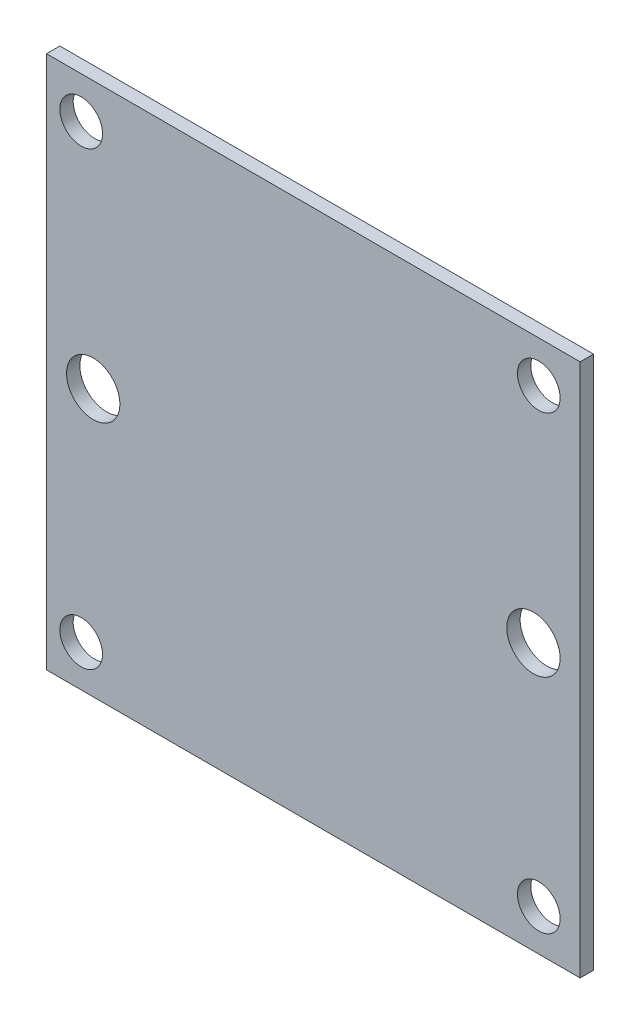
ISO-10303-21;
HEADER;
FILE_DESCRIPTION(('STEP AP214'),'2;1');
FILE_NAME('part.step','',(''),(''),'','','');
FILE_SCHEMA(('AUTOMOTIVE_DESIGN { 1 0 10303 214 1 1 1 1 }'));
ENDSEC;
DATA;
#1=APPLICATION_CONTEXT('core data for automotive mechanical design processes');
#2=APPLICATION_PROTOCOL_DEFINITION('international standard','automotive_design',2000,#1);
#3=PRODUCT_CONTEXT('',#1,'mechanical');
#4=PRODUCT('Part','Part','',(#3));
#5=PRODUCT_RELATED_PRODUCT_CATEGORY('part','',(#4));
#6=PRODUCT_DEFINITION_FORMATION('','',#4);
#7=PRODUCT_DEFINITION_CONTEXT('part definition',#1,'design');
#8=PRODUCT_DEFINITION('design','',#6,#7);
#9=PRODUCT_DEFINITION_SHAPE('','',#8);
#10=(LENGTH_UNIT() NAMED_UNIT(*) SI_UNIT(.MILLI.,.METRE.));
#11=(NAMED_UNIT(*) PLANE_ANGLE_UNIT() SI_UNIT($,.RADIAN.));
#12=(NAMED_UNIT(*) SI_UNIT($,.STERADIAN.) SOLID_ANGLE_UNIT());
#13=UNCERTAINTY_MEASURE_WITH_UNIT(LENGTH_MEASURE(1.E-05),#10,'distance_accuracy_value','');
#14=(GEOMETRIC_REPRESENTATION_CONTEXT(3) GLOBAL_UNCERTAINTY_ASSIGNED_CONTEXT((#13)) GLOBAL_UNIT_ASSIGNED_CONTEXT((#10,
#11,#12)) REPRESENTATION_CONTEXT('',''));
#15=CARTESIAN_POINT('',(0.,0.,0.));
#16=DIRECTION('',(0.,0.,1.));
#17=DIRECTION('',(1.,0.,0.));
#18=AXIS2_PLACEMENT_3D('',#15,#16,#17);
#19=CARTESIAN_POINT('',(20.,20.,1.));
#20=DIRECTION('',(-1.,0.,0.));
#21=DIRECTION('',(0.,0.,1.));
#22=AXIS2_PLACEMENT_3D('',#19,#20,#21);
#23=PLANE('',#22);
#24=DIRECTION('',(0.,1.,0.));
#25=VECTOR('',#24,1.);
#26=CARTESIAN_POINT('',(20.,20.,0.));
#27=LINE('',#26,#25);
#28=CARTESIAN_POINT('',(20.,-20.,0.));
#29=VERTEX_POINT('',#28);
#30=CARTESIAN_POINT('',(20.,20.,0.));
#31=VERTEX_POINT('',#30);
#32=EDGE_CURVE('E98',#29,#31,#27,.T.);
#33=ORIENTED_EDGE('',*,*,#32,.T.);
#34=DIRECTION('',(0.,0.,-1.));
#35=VECTOR('',#34,1.);
#36=CARTESIAN_POINT('',(20.,20.,1.));
#37=LINE('',#36,#35);
#38=CARTESIAN_POINT('',(20.,20.,1.));
#39=VERTEX_POINT('',#38);
#40=EDGE_CURVE('E11',#39,#31,#37,.T.);
#41=ORIENTED_EDGE('',*,*,#40,.F.);
#42=DIRECTION('',(0.,1.,0.));
#43=VECTOR('',#42,1.);
#44=CARTESIAN_POINT('',(20.,20.,1.));
#45=LINE('',#44,#43);
#46=CARTESIAN_POINT('',(20.,-20.,1.));
#47=VERTEX_POINT('',#46);
#48=EDGE_CURVE('E85',#47,#39,#45,.T.);
#49=ORIENTED_EDGE('',*,*,#48,.F.);
#50=DIRECTION('',(0.,0.,-1.));
#51=VECTOR('',#50,1.);
#52=CARTESIAN_POINT('',(20.,-20.,1.));
#53=LINE('',#52,#51);
#54=EDGE_CURVE('E94',#47,#29,#53,.T.);
#55=ORIENTED_EDGE('',*,*,#54,.T.);
#56=EDGE_LOOP('',(#33,#41,#49,#55));
#57=FACE_BOUND('',#56,.T.);
#58=ADVANCED_FACE('F32',(#57),#23,.F.);
#59=CARTESIAN_POINT('',(-20.,20.,1.));
#60=DIRECTION('',(0.,-1.,0.));
#61=DIRECTION('',(0.,0.,-1.));
#62=AXIS2_PLACEMENT_3D('',#59,#60,#61);
#63=PLANE('',#62);
#64=DIRECTION('',(-1.,0.,0.));
#65=VECTOR('',#64,1.);
#66=CARTESIAN_POINT('',(-20.,20.,0.));
#67=LINE('',#66,#65);
#68=CARTESIAN_POINT('',(-20.,20.,0.));
#69=VERTEX_POINT('',#68);
#70=EDGE_CURVE('E89',#31,#69,#67,.T.);
#71=ORIENTED_EDGE('',*,*,#70,.T.);
#72=DIRECTION('',(0.,0.,-1.));
#73=VECTOR('',#72,1.);
#74=CARTESIAN_POINT('',(-20.,20.,1.));
#75=LINE('',#74,#73);
#76=CARTESIAN_POINT('',(-20.,20.,1.));
#77=VERTEX_POINT('',#76);
#78=EDGE_CURVE('E41',#77,#69,#75,.T.);
#79=ORIENTED_EDGE('',*,*,#78,.F.);
#80=DIRECTION('',(-1.,0.,0.));
#81=VECTOR('',#80,1.);
#82=CARTESIAN_POINT('',(-20.,20.,1.));
#83=LINE('',#82,#81);
#84=EDGE_CURVE('E80',#39,#77,#83,.T.);
#85=ORIENTED_EDGE('',*,*,#84,.F.);
#86=ORIENTED_EDGE('',*,*,#40,.T.);
#87=EDGE_LOOP('',(#71,#79,#85,#86));
#88=FACE_BOUND('',#87,.T.);
#89=ADVANCED_FACE('F88',(#88),#63,.F.);
#90=CARTESIAN_POINT('',(-20.,20.,1.));
#91=DIRECTION('',(1.,0.,0.));
#92=DIRECTION('',(0.,1.,0.));
#93=AXIS2_PLACEMENT_3D('',#90,#91,#92);
#94=PLANE('',#93);
#95=DIRECTION('',(0.,-1.,0.));
#96=VECTOR('',#95,1.);
#97=CARTESIAN_POINT('',(-20.,20.,0.));
#98=LINE('',#97,#96);
#99=CARTESIAN_POINT('',(-20.,-20.,0.));
#100=VERTEX_POINT('',#99);
#101=EDGE_CURVE('E67',#69,#100,#98,.T.);
#102=ORIENTED_EDGE('',*,*,#101,.T.);
#103=DIRECTION('',(0.,0.,-1.));
#104=VECTOR('',#103,1.);
#105=CARTESIAN_POINT('',(-20.,-20.,1.));
#106=LINE('',#105,#104);
#107=CARTESIAN_POINT('',(-20.,-20.,1.));
#108=VERTEX_POINT('',#107);
#109=EDGE_CURVE('E90',#108,#100,#106,.T.);
#110=ORIENTED_EDGE('',*,*,#109,.F.);
#111=DIRECTION('',(0.,-1.,0.));
#112=VECTOR('',#111,1.);
#113=CARTESIAN_POINT('',(-20.,20.,1.));
#114=LINE('',#113,#112);
#115=EDGE_CURVE('E83',#77,#108,#114,.T.);
#116=ORIENTED_EDGE('',*,*,#115,.F.);
#117=ORIENTED_EDGE('',*,*,#78,.T.);
#118=EDGE_LOOP('',(#102,#110,#116,#117));
#119=FACE_BOUND('',#118,.T.);
#120=ADVANCED_FACE('F92',(#119),#94,.F.);
#121=CARTESIAN_POINT('',(-20.,-20.,1.));
#122=DIRECTION('',(0.,1.,0.));
#123=DIRECTION('',(0.,0.,1.));
#124=AXIS2_PLACEMENT_3D('',#121,#122,#123);
#125=PLANE('',#124);
#126=DIRECTION('',(1.,0.,0.));
#127=VECTOR('',#126,1.);
#128=CARTESIAN_POINT('',(-20.,-20.,0.));
#129=LINE('',#128,#127);
#130=EDGE_CURVE('E73',#100,#29,#129,.T.);
#131=ORIENTED_EDGE('',*,*,#130,.T.);
#132=ORIENTED_EDGE('',*,*,#54,.F.);
#133=DIRECTION('',(1.,0.,0.));
#134=VECTOR('',#133,1.);
#135=CARTESIAN_POINT('',(-20.,-20.,1.));
#136=LINE('',#135,#134);
#137=EDGE_CURVE('E50',#108,#47,#136,.T.);
#138=ORIENTED_EDGE('',*,*,#137,.F.);
#139=ORIENTED_EDGE('',*,*,#109,.T.);
#140=EDGE_LOOP('',(#131,#132,#138,#139));
#141=FACE_BOUND('',#140,.T.);
#142=ADVANCED_FACE('F148',(#141),#125,.F.);
#143=CARTESIAN_POINT('',(0.,0.,1.));
#144=DIRECTION('',(0.,0.,1.));
#145=DIRECTION('',(1.,0.,0.));
#146=AXIS2_PLACEMENT_3D('',#143,#144,#145);
#147=PLANE('',#146);
#148=CARTESIAN_POINT('',(-16.5,0.,1.));
#149=DIRECTION('',(0.,0.,1.));
#150=DIRECTION('',(1.,0.,0.));
#151=AXIS2_PLACEMENT_3D('',#148,#149,#150);
#152=CIRCLE('',#151,2.);
#153=CARTESIAN_POINT('',(-14.5,0.,1.));
#154=VERTEX_POINT('',#153);
#155=EDGE_CURVE('E133',#154,#154,#152,.T.);
#156=ORIENTED_EDGE('',*,*,#155,.F.);
#157=EDGE_LOOP('',(#156));
#158=FACE_BOUND('',#157,.T.);
#159=CARTESIAN_POINT('',(16.5,0.,1.));
#160=DIRECTION('',(0.,0.,1.));
#161=DIRECTION('',(1.,0.,0.));
#162=AXIS2_PLACEMENT_3D('',#159,#160,#161);
#163=CIRCLE('',#162,2.);
#164=CARTESIAN_POINT('',(18.5,0.,1.));
#165=VERTEX_POINT('',#164);
#166=EDGE_CURVE('E123',#165,#165,#163,.T.);
#167=ORIENTED_EDGE('',*,*,#166,.F.);
#168=EDGE_LOOP('',(#167));
#169=FACE_BOUND('',#168,.T.);
#170=CARTESIAN_POINT('',(-17.4,16.9,1.));
#171=DIRECTION('',(0.,0.,1.));
#172=DIRECTION('',(1.,0.,0.));
#173=AXIS2_PLACEMENT_3D('',#170,#171,#172);
#174=CIRCLE('',#173,1.6);
#175=CARTESIAN_POINT('',(-15.8,16.9,1.));
#176=VERTEX_POINT('',#175);
#177=EDGE_CURVE('E120',#176,#176,#174,.T.);
#178=ORIENTED_EDGE('',*,*,#177,.F.);
#179=EDGE_LOOP('',(#178));
#180=FACE_BOUND('',#179,.T.);
#181=CARTESIAN_POINT('',(16.9,16.9,1.));
#182=DIRECTION('',(0.,0.,1.));
#183=DIRECTION('',(1.,0.,0.));
#184=AXIS2_PLACEMENT_3D('',#181,#182,#183);
#185=CIRCLE('',#184,1.6);
#186=CARTESIAN_POINT('',(18.5,16.9,1.));
#187=VERTEX_POINT('',#186);
#188=EDGE_CURVE('E117',#187,#187,#185,.T.);
#189=ORIENTED_EDGE('',*,*,#188,.F.);
#190=EDGE_LOOP('',(#189));
#191=FACE_BOUND('',#190,.T.);
#192=CARTESIAN_POINT('',(16.9,-16.9,1.));
#193=DIRECTION('',(0.,0.,1.));
#194=DIRECTION('',(1.,0.,0.));
#195=AXIS2_PLACEMENT_3D('',#192,#193,#194);
#196=CIRCLE('',#195,1.6);
#197=CARTESIAN_POINT('',(18.5,-16.9,1.));
#198=VERTEX_POINT('',#197);
#199=EDGE_CURVE('E113',#198,#198,#196,.T.);
#200=ORIENTED_EDGE('',*,*,#199,.F.);
#201=EDGE_LOOP('',(#200));
#202=FACE_BOUND('',#201,.T.);
#203=CARTESIAN_POINT('',(-17.4,-16.9,1.));
#204=DIRECTION('',(0.,0.,1.));
#205=DIRECTION('',(1.,0.,0.));
#206=AXIS2_PLACEMENT_3D('',#203,#204,#205);
#207=CIRCLE('',#206,1.6);
#208=CARTESIAN_POINT('',(-15.8,-16.9,1.));
#209=VERTEX_POINT('',#208);
#210=EDGE_CURVE('E109',#209,#209,#207,.T.);
#211=ORIENTED_EDGE('',*,*,#210,.F.);
#212=EDGE_LOOP('',(#211));
#213=FACE_BOUND('',#212,.T.);
#214=ORIENTED_EDGE('',*,*,#48,.T.);
#215=ORIENTED_EDGE('',*,*,#84,.T.);
#216=ORIENTED_EDGE('',*,*,#115,.T.);
#217=ORIENTED_EDGE('',*,*,#137,.T.);
#218=EDGE_LOOP('',(#214,#215,#216,#217));
#219=FACE_BOUND('',#218,.T.);
#220=ADVANCED_FACE('F81',(#158,#169,#180,#191,#202,#213,#219),#147,.T.);
#221=CARTESIAN_POINT('',(0.,0.,0.));
#222=DIRECTION('',(0.,0.,1.));
#223=DIRECTION('',(1.,0.,0.));
#224=AXIS2_PLACEMENT_3D('',#221,#222,#223);
#225=PLANE('',#224);
#226=CARTESIAN_POINT('',(-16.5,0.,0.));
#227=DIRECTION('',(0.,0.,1.));
#228=DIRECTION('',(1.,0.,0.));
#229=AXIS2_PLACEMENT_3D('',#226,#227,#228);
#230=CIRCLE('',#229,2.);
#231=CARTESIAN_POINT('',(-14.5,0.,0.));
#232=VERTEX_POINT('',#231);
#233=EDGE_CURVE('E35',#232,#232,#230,.T.);
#234=ORIENTED_EDGE('',*,*,#233,.T.);
#235=EDGE_LOOP('',(#234));
#236=FACE_BOUND('',#235,.T.);
#237=CARTESIAN_POINT('',(16.5,0.,0.));
#238=DIRECTION('',(0.,0.,1.));
#239=DIRECTION('',(1.,0.,0.));
#240=AXIS2_PLACEMENT_3D('',#237,#238,#239);
#241=CIRCLE('',#240,2.);
#242=CARTESIAN_POINT('',(18.5,0.,0.));
#243=VERTEX_POINT('',#242);
#244=EDGE_CURVE('E121',#243,#243,#241,.T.);
#245=ORIENTED_EDGE('',*,*,#244,.T.);
#246=EDGE_LOOP('',(#245));
#247=FACE_BOUND('',#246,.T.);
#248=CARTESIAN_POINT('',(-17.4,16.9,0.));
#249=DIRECTION('',(0.,0.,1.));
#250=DIRECTION('',(1.,0.,0.));
#251=AXIS2_PLACEMENT_3D('',#248,#249,#250);
#252=CIRCLE('',#251,1.6);
#253=CARTESIAN_POINT('',(-15.8,16.9,0.));
#254=VERTEX_POINT('',#253);
#255=EDGE_CURVE('E118',#254,#254,#252,.T.);
#256=ORIENTED_EDGE('',*,*,#255,.T.);
#257=EDGE_LOOP('',(#256));
#258=FACE_BOUND('',#257,.T.);
#259=CARTESIAN_POINT('',(16.9,16.9,0.));
#260=DIRECTION('',(0.,0.,1.));
#261=DIRECTION('',(1.,0.,0.));
#262=AXIS2_PLACEMENT_3D('',#259,#260,#261);
#263=CIRCLE('',#262,1.6);
#264=CARTESIAN_POINT('',(18.5,16.9,0.));
#265=VERTEX_POINT('',#264);
#266=EDGE_CURVE('E114',#265,#265,#263,.T.);
#267=ORIENTED_EDGE('',*,*,#266,.T.);
#268=EDGE_LOOP('',(#267));
#269=FACE_BOUND('',#268,.T.);
#270=CARTESIAN_POINT('',(16.9,-16.9,0.));
#271=DIRECTION('',(0.,0.,1.));
#272=DIRECTION('',(1.,0.,0.));
#273=AXIS2_PLACEMENT_3D('',#270,#271,#272);
#274=CIRCLE('',#273,1.6);
#275=CARTESIAN_POINT('',(18.5,-16.9,0.));
#276=VERTEX_POINT('',#275);
#277=EDGE_CURVE('E110',#276,#276,#274,.T.);
#278=ORIENTED_EDGE('',*,*,#277,.T.);
#279=EDGE_LOOP('',(#278));
#280=FACE_BOUND('',#279,.T.);
#281=CARTESIAN_POINT('',(-17.4,-16.9,0.));
#282=DIRECTION('',(0.,0.,1.));
#283=DIRECTION('',(1.,0.,0.));
#284=AXIS2_PLACEMENT_3D('',#281,#282,#283);
#285=CIRCLE('',#284,1.6);
#286=CARTESIAN_POINT('',(-15.8,-16.9,0.));
#287=VERTEX_POINT('',#286);
#288=EDGE_CURVE('E101',#287,#287,#285,.T.);
#289=ORIENTED_EDGE('',*,*,#288,.T.);
#290=EDGE_LOOP('',(#289));
#291=FACE_BOUND('',#290,.T.);
#292=ORIENTED_EDGE('',*,*,#32,.F.);
#293=ORIENTED_EDGE('',*,*,#130,.F.);
#294=ORIENTED_EDGE('',*,*,#101,.F.);
#295=ORIENTED_EDGE('',*,*,#70,.F.);
#296=EDGE_LOOP('',(#292,#293,#294,#295));
#297=FACE_BOUND('',#296,.T.);
#298=ADVANCED_FACE('F147',(#236,#247,#258,#269,#280,#291,#297),#225,.F.);
#299=CARTESIAN_POINT('',(-17.4,-16.9,-9.));
#300=DIRECTION('',(0.,0.,1.));
#301=DIRECTION('',(1.,0.,0.));
#302=AXIS2_PLACEMENT_3D('',#299,#300,#301);
#303=CYLINDRICAL_SURFACE('',#302,1.6);
#304=ORIENTED_EDGE('',*,*,#210,.T.);
#305=EDGE_LOOP('',(#304));
#306=FACE_BOUND('',#305,.T.);
#307=ORIENTED_EDGE('',*,*,#288,.F.);
#308=EDGE_LOOP('',(#307));
#309=FACE_BOUND('',#308,.T.);
#310=ADVANCED_FACE('F143',(#306,#309),#303,.F.);
#311=CARTESIAN_POINT('',(16.9,-16.9,-9.));
#312=DIRECTION('',(0.,0.,1.));
#313=DIRECTION('',(1.,0.,0.));
#314=AXIS2_PLACEMENT_3D('',#311,#312,#313);
#315=CYLINDRICAL_SURFACE('',#314,1.6);
#316=ORIENTED_EDGE('',*,*,#199,.T.);
#317=EDGE_LOOP('',(#316));
#318=FACE_BOUND('',#317,.T.);
#319=ORIENTED_EDGE('',*,*,#277,.F.);
#320=EDGE_LOOP('',(#319));
#321=FACE_BOUND('',#320,.T.);
#322=ADVANCED_FACE('F197',(#318,#321),#315,.F.);
#323=CARTESIAN_POINT('',(16.9,16.9,-9.));
#324=DIRECTION('',(0.,0.,1.));
#325=DIRECTION('',(1.,0.,0.));
#326=AXIS2_PLACEMENT_3D('',#323,#324,#325);
#327=CYLINDRICAL_SURFACE('',#326,1.6);
#328=ORIENTED_EDGE('',*,*,#188,.T.);
#329=EDGE_LOOP('',(#328));
#330=FACE_BOUND('',#329,.T.);
#331=ORIENTED_EDGE('',*,*,#266,.F.);
#332=EDGE_LOOP('',(#331));
#333=FACE_BOUND('',#332,.T.);
#334=ADVANCED_FACE('F205',(#330,#333),#327,.F.);
#335=CARTESIAN_POINT('',(-17.4,16.9,-9.));
#336=DIRECTION('',(0.,0.,1.));
#337=DIRECTION('',(1.,0.,0.));
#338=AXIS2_PLACEMENT_3D('',#335,#336,#337);
#339=CYLINDRICAL_SURFACE('',#338,1.6);
#340=ORIENTED_EDGE('',*,*,#177,.T.);
#341=EDGE_LOOP('',(#340));
#342=FACE_BOUND('',#341,.T.);
#343=ORIENTED_EDGE('',*,*,#255,.F.);
#344=EDGE_LOOP('',(#343));
#345=FACE_BOUND('',#344,.T.);
#346=ADVANCED_FACE('F215',(#342,#345),#339,.F.);
#347=CARTESIAN_POINT('',(16.5,0.,-9.));
#348=DIRECTION('',(0.,0.,1.));
#349=DIRECTION('',(1.,0.,0.));
#350=AXIS2_PLACEMENT_3D('',#347,#348,#349);
#351=CYLINDRICAL_SURFACE('',#350,2.);
#352=ORIENTED_EDGE('',*,*,#166,.T.);
#353=EDGE_LOOP('',(#352));
#354=FACE_BOUND('',#353,.T.);
#355=ORIENTED_EDGE('',*,*,#244,.F.);
#356=EDGE_LOOP('',(#355));
#357=FACE_BOUND('',#356,.T.);
#358=ADVANCED_FACE('F225',(#354,#357),#351,.F.);
#359=CARTESIAN_POINT('',(-16.5,0.,-9.));
#360=DIRECTION('',(0.,0.,1.));
#361=DIRECTION('',(1.,0.,0.));
#362=AXIS2_PLACEMENT_3D('',#359,#360,#361);
#363=CYLINDRICAL_SURFACE('',#362,2.);
#364=ORIENTED_EDGE('',*,*,#155,.T.);
#365=EDGE_LOOP('',(#364));
#366=FACE_BOUND('',#365,.T.);
#367=ORIENTED_EDGE('',*,*,#233,.F.);
#368=EDGE_LOOP('',(#367));
#369=FACE_BOUND('',#368,.T.);
#370=ADVANCED_FACE('F235',(#366,#369),#363,.F.);
#371=CLOSED_SHELL('',(#58,#89,#120,#142,#220,#298,#310,#322,#334,#346,#358,#370));
#372=MANIFOLD_SOLID_BREP('B2',#371);
#373=ADVANCED_BREP_SHAPE_REPRESENTATION('',(#18,#372),#14);
#374=SHAPE_DEFINITION_REPRESENTATION(#9,#373);
ENDSEC;
END-ISO-10303-21;
